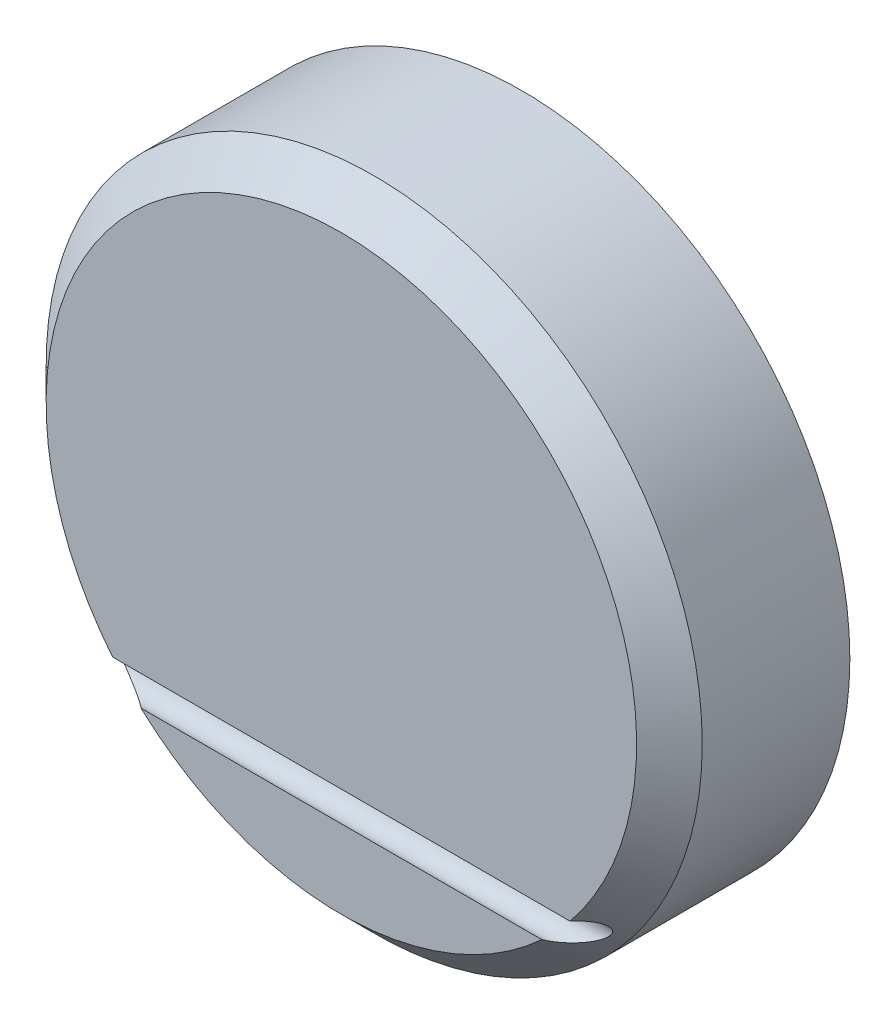
ISO-10303-21;
HEADER;
FILE_DESCRIPTION(('STEP AP214'),'2;1');
FILE_NAME('part.step','',(''),(''),'','','');
FILE_SCHEMA(('AUTOMOTIVE_DESIGN { 1 0 10303 214 1 1 1 1 }'));
ENDSEC;
DATA;
#1=APPLICATION_CONTEXT('core data for automotive mechanical design processes');
#2=APPLICATION_PROTOCOL_DEFINITION('international standard','automotive_design',2000,#1);
#3=PRODUCT_CONTEXT('',#1,'mechanical');
#4=PRODUCT('Part','Part','',(#3));
#5=PRODUCT_RELATED_PRODUCT_CATEGORY('part','',(#4));
#6=PRODUCT_DEFINITION_FORMATION('','',#4);
#7=PRODUCT_DEFINITION_CONTEXT('part definition',#1,'design');
#8=PRODUCT_DEFINITION('design','',#6,#7);
#9=PRODUCT_DEFINITION_SHAPE('','',#8);
#10=(LENGTH_UNIT() NAMED_UNIT(*) SI_UNIT(.MILLI.,.METRE.));
#11=(NAMED_UNIT(*) PLANE_ANGLE_UNIT() SI_UNIT($,.RADIAN.));
#12=(NAMED_UNIT(*) SI_UNIT($,.STERADIAN.) SOLID_ANGLE_UNIT());
#13=UNCERTAINTY_MEASURE_WITH_UNIT(LENGTH_MEASURE(1.E-05),#10,'distance_accuracy_value','');
#14=(GEOMETRIC_REPRESENTATION_CONTEXT(3) GLOBAL_UNCERTAINTY_ASSIGNED_CONTEXT((#13)) GLOBAL_UNIT_ASSIGNED_CONTEXT((#10,
#11,#12)) REPRESENTATION_CONTEXT('',''));
#15=CARTESIAN_POINT('',(0.,0.,0.));
#16=DIRECTION('',(0.,0.,1.));
#17=DIRECTION('',(1.,0.,0.));
#18=AXIS2_PLACEMENT_3D('',#15,#16,#17);
#19=CARTESIAN_POINT('',(0.,0.,0.));
#20=DIRECTION('',(0.,0.,1.));
#21=DIRECTION('',(1.,0.,0.));
#22=AXIS2_PLACEMENT_3D('',#19,#20,#21);
#23=PLANE('',#22);
#24=DIRECTION('',(1.,0.,0.));
#25=VECTOR('',#24,1.);
#26=CARTESIAN_POINT('',(-10.,-6.60825756949558,0.));
#27=LINE('',#26,#25);
#28=CARTESIAN_POINT('',(-6.10990440966177,-6.60825756949558,0.));
#29=VERTEX_POINT('',#28);
#30=CARTESIAN_POINT('',(6.10990440966177,-6.60825756949558,0.));
#31=VERTEX_POINT('',#30);
#32=EDGE_CURVE('E70',#29,#31,#27,.T.);
#33=ORIENTED_EDGE('',*,*,#32,.F.);
#34=CARTESIAN_POINT('',(0.,0.,0.));
#35=DIRECTION('',(0.,0.,1.));
#36=DIRECTION('',(1.,0.,0.));
#37=AXIS2_PLACEMENT_3D('',#34,#35,#36);
#38=CIRCLE('',#37,9.);
#39=EDGE_CURVE('E83',#29,#31,#38,.T.);
#40=ORIENTED_EDGE('',*,*,#39,.T.);
#41=EDGE_LOOP('',(#33,#40));
#42=FACE_BOUND('',#41,.T.);
#43=ADVANCED_FACE('F46',(#42),#23,.T.);
#44=CARTESIAN_POINT('',(0.,0.,-4.5));
#45=DIRECTION('',(0.,0.,1.));
#46=DIRECTION('',(1.,0.,0.));
#47=AXIS2_PLACEMENT_3D('',#44,#45,#46);
#48=PLANE('',#47);
#49=CARTESIAN_POINT('',(0.,0.,-4.5));
#50=DIRECTION('',(0.,0.,1.));
#51=DIRECTION('',(1.,0.,0.));
#52=AXIS2_PLACEMENT_3D('',#49,#50,#51);
#53=CIRCLE('',#52,8.25);
#54=CARTESIAN_POINT('',(8.25,0.,-4.5));
#55=VERTEX_POINT('',#54);
#56=EDGE_CURVE('E94',#55,#55,#53,.T.);
#57=ORIENTED_EDGE('',*,*,#56,.T.);
#58=EDGE_LOOP('',(#57));
#59=FACE_BOUND('',#58,.T.);
#60=CARTESIAN_POINT('',(0.,0.,-4.5));
#61=DIRECTION('',(0.,0.,-1.));
#62=DIRECTION('',(-1.,0.,0.));
#63=AXIS2_PLACEMENT_3D('',#60,#61,#62);
#64=CIRCLE('',#63,9.2);
#65=CARTESIAN_POINT('',(-9.2,0.,-4.5));
#66=VERTEX_POINT('',#65);
#67=EDGE_CURVE('E84',#66,#66,#64,.T.);
#68=ORIENTED_EDGE('',*,*,#67,.T.);
#69=EDGE_LOOP('',(#68));
#70=FACE_BOUND('',#69,.T.);
#71=ADVANCED_FACE('F125',(#59,#70),#48,.F.);
#72=CARTESIAN_POINT('',(0.,0.,-4.5));
#73=DIRECTION('',(0.,0.,1.));
#74=DIRECTION('',(1.,0.,0.));
#75=AXIS2_PLACEMENT_3D('',#72,#73,#74);
#76=CYLINDRICAL_SURFACE('',#75,8.25);
#77=CARTESIAN_POINT('',(0.,0.,-1.5));
#78=DIRECTION('',(0.,0.,1.));
#79=DIRECTION('',(1.,0.,0.));
#80=AXIS2_PLACEMENT_3D('',#77,#78,#79);
#81=CIRCLE('',#80,8.25);
#82=CARTESIAN_POINT('',(8.25,0.,-1.5));
#83=VERTEX_POINT('',#82);
#84=EDGE_CURVE('E80',#83,#83,#81,.T.);
#85=ORIENTED_EDGE('',*,*,#84,.T.);
#86=EDGE_LOOP('',(#85));
#87=FACE_BOUND('',#86,.T.);
#88=ORIENTED_EDGE('',*,*,#56,.F.);
#89=EDGE_LOOP('',(#88));
#90=FACE_BOUND('',#89,.T.);
#91=ADVANCED_FACE('F123',(#87,#90),#76,.F.);
#92=CARTESIAN_POINT('',(0.,0.,-1.));
#93=DIRECTION('',(0.,0.,1.));
#94=DIRECTION('',(1.,0.,0.));
#95=AXIS2_PLACEMENT_3D('',#92,#93,#94);
#96=PLANE('',#95);
#97=CARTESIAN_POINT('',(0.,0.,-1.));
#98=DIRECTION('',(0.,0.,1.));
#99=DIRECTION('',(1.,0.,0.));
#100=AXIS2_PLACEMENT_3D('',#97,#98,#99);
#101=CIRCLE('',#100,7.75);
#102=CARTESIAN_POINT('',(7.75,0.,-1.));
#103=VERTEX_POINT('',#102);
#104=EDGE_CURVE('E92',#103,#103,#101,.F.);
#105=ORIENTED_EDGE('',*,*,#104,.T.);
#106=EDGE_LOOP('',(#105));
#107=FACE_BOUND('',#106,.T.);
#108=ADVANCED_FACE('F119',(#107),#96,.F.);
#109=CARTESIAN_POINT('',(0.,0.,-5.5));
#110=DIRECTION('',(0.,0.,-1.));
#111=DIRECTION('',(-1.,0.,0.));
#112=AXIS2_PLACEMENT_3D('',#109,#110,#111);
#113=PLANE('',#112);
#114=CARTESIAN_POINT('',(0.,0.,-5.5));
#115=DIRECTION('',(0.,0.,-1.));
#116=DIRECTION('',(-1.,0.,0.));
#117=AXIS2_PLACEMENT_3D('',#114,#115,#116);
#118=CIRCLE('',#117,10.);
#119=CARTESIAN_POINT('',(-10.,0.,-5.5));
#120=VERTEX_POINT('',#119);
#121=EDGE_CURVE('E222',#120,#120,#118,.T.);
#122=ORIENTED_EDGE('',*,*,#121,.T.);
#123=EDGE_LOOP('',(#122));
#124=FACE_BOUND('',#123,.T.);
#125=CARTESIAN_POINT('',(0.,0.,-5.5));
#126=DIRECTION('',(0.,0.,-1.));
#127=DIRECTION('',(-1.,0.,0.));
#128=AXIS2_PLACEMENT_3D('',#125,#126,#127);
#129=CIRCLE('',#128,9.2);
#130=CARTESIAN_POINT('',(-9.2,0.,-5.5));
#131=VERTEX_POINT('',#130);
#132=EDGE_CURVE('E224',#131,#131,#129,.T.);
#133=ORIENTED_EDGE('',*,*,#132,.F.);
#134=EDGE_LOOP('',(#133));
#135=FACE_BOUND('',#134,.T.);
#136=ADVANCED_FACE('F115',(#124,#135),#113,.T.);
#137=CARTESIAN_POINT('',(0.,0.,-5.5));
#138=DIRECTION('',(0.,0.,1.));
#139=DIRECTION('',(1.,0.,0.));
#140=AXIS2_PLACEMENT_3D('',#137,#138,#139);
#141=CYLINDRICAL_SURFACE('',#140,9.2);
#142=ORIENTED_EDGE('',*,*,#132,.T.);
#143=EDGE_LOOP('',(#142));
#144=FACE_BOUND('',#143,.T.);
#145=ORIENTED_EDGE('',*,*,#67,.F.);
#146=EDGE_LOOP('',(#145));
#147=FACE_BOUND('',#146,.T.);
#148=ADVANCED_FACE('F110',(#144,#147),#141,.F.);
#149=DIRECTION('',(1.,0.,0.));
#150=VECTOR('',#149,1.);
#151=CARTESIAN_POINT('',(-10.,-5.69174243050442,0.));
#152=LINE('',#151,#150);
#153=CARTESIAN_POINT('',(6.97166178932941,-5.69174243050442,0.));
#154=VERTEX_POINT('',#153);
#155=CARTESIAN_POINT('',(-6.97166178932941,-5.69174243050442,0.));
#156=VERTEX_POINT('',#155);
#157=EDGE_CURVE('E65',#154,#156,#152,.F.);
#158=ORIENTED_EDGE('',*,*,#157,.F.);
#159=EDGE_CURVE('E89',#154,#156,#38,.T.);
#160=ORIENTED_EDGE('',*,*,#159,.T.);
#161=EDGE_LOOP('',(#158,#160));
#162=FACE_BOUND('',#161,.T.);
#163=ADVANCED_FACE('F114',(#162),#23,.T.);
#164=CARTESIAN_POINT('',(0.,0.,-4.5));
#165=DIRECTION('',(0.,0.,1.));
#166=DIRECTION('',(1.,0.,0.));
#167=AXIS2_PLACEMENT_3D('',#164,#165,#166);
#168=CYLINDRICAL_SURFACE('',#167,10.);
#169=CARTESIAN_POINT('',(0.,0.,-1.));
#170=DIRECTION('',(0.,0.,1.));
#171=DIRECTION('',(1.,0.,0.));
#172=AXIS2_PLACEMENT_3D('',#169,#170,#171);
#173=CIRCLE('',#172,10.);
#174=CARTESIAN_POINT('',(10.,0.,-1.));
#175=VERTEX_POINT('',#174);
#176=EDGE_CURVE('E88',#175,#175,#173,.F.);
#177=ORIENTED_EDGE('',*,*,#176,.T.);
#178=EDGE_LOOP('',(#177));
#179=FACE_BOUND('',#178,.T.);
#180=ORIENTED_EDGE('',*,*,#121,.F.);
#181=EDGE_LOOP('',(#180));
#182=FACE_BOUND('',#181,.T.);
#183=ADVANCED_FACE('F131',(#179,#182),#168,.T.);
#184=CARTESIAN_POINT('',(0.,0.,0.));
#185=DIRECTION('',(0.,0.,-1.));
#186=DIRECTION('',(-1.,0.,0.));
#187=AXIS2_PLACEMENT_3D('',#184,#185,#186);
#188=CONICAL_SURFACE('',#187,9.,0.785398163397447);
#189=CARTESIAN_POINT('',(6.04707990306705,-6.57070412405866,0.0702000000000661));
#190=CARTESIAN_POINT('',(6.05693556190833,-6.57881088669558,0.05756055493887));
#191=CARTESIAN_POINT('',(6.06754977139067,-6.58606310345228,0.045036347611117));
#192=CARTESIAN_POINT('',(6.08991784553527,-6.59906163342238,0.0203174837959343));
#193=CARTESIAN_POINT('',(6.10166717019198,-6.60481363093669,0.00812174513162114));
#194=CARTESIAN_POINT('',(6.13784049260138,-6.62006074375487,-0.0276340605502827));
#195=CARTESIAN_POINT('',(6.16348253832726,-6.62775892532108,-0.0507165070537371));
#196=CARTESIAN_POINT('',(6.21296748391777,-6.63871142905341,-0.0924846089058218));
#197=CARTESIAN_POINT('',(6.23657842432309,-6.64242880171015,-0.111340431121426));
#198=CARTESIAN_POINT('',(6.28472538204472,-6.64765167416868,-0.14815813985347));
#199=CARTESIAN_POINT('',(6.3092616883048,-6.64915647713574,-0.166119743021313));
#200=CARTESIAN_POINT('',(6.38430600743481,-6.65089900824148,-0.219141289813463));
#201=CARTESIAN_POINT('',(6.43577011489377,-6.64827737753146,-0.252948224364271));
#202=CARTESIAN_POINT('',(6.53199141355663,-6.63791048952041,-0.312761914263152));
#203=CARTESIAN_POINT('',(6.5765983457482,-6.63099164774556,-0.339178481180339));
#204=CARTESIAN_POINT('',(6.66622413025622,-6.61326974200197,-0.390018161700298));
#205=CARTESIAN_POINT('',(6.71124326022732,-6.60246383814802,-0.414439801761306));
#206=CARTESIAN_POINT('',(6.8011190118182,-6.57720676752466,-0.461143670958125));
#207=CARTESIAN_POINT('',(6.84597555619378,-6.56277048530252,-0.483434134991384));
#208=CARTESIAN_POINT('',(6.93535606231698,-6.53021308829522,-0.525808880840292));
#209=CARTESIAN_POINT('',(6.97988024662668,-6.5120947223237,-0.54589479131075));
#210=CARTESIAN_POINT('',(7.07255611966599,-6.46999544982295,-0.585378392279778));
#211=CARTESIAN_POINT('',(7.12063838721544,-6.44561525485041,-0.604518181024212));
#212=CARTESIAN_POINT('',(7.21524827149776,-6.39156892695091,-0.638946787583639));
#213=CARTESIAN_POINT('',(7.26177680574653,-6.36190598158968,-0.654237914295032));
#214=CARTESIAN_POINT('',(7.33772332168257,-6.30662018569768,-0.675445795955978));
#215=CARTESIAN_POINT('',(7.36793272510205,-6.28264587406788,-0.68279857351335));
#216=CARTESIAN_POINT('',(7.42607214929614,-6.23132149780307,-0.694042231051359));
#217=CARTESIAN_POINT('',(7.45400685425117,-6.20397867757412,-0.69794039753474));
#218=CARTESIAN_POINT('',(7.49572814351631,-6.1570847908733,-0.70026139326081));
#219=CARTESIAN_POINT('',(7.51074796429544,-6.13871649063703,-0.700237786807346));
#220=CARTESIAN_POINT('',(7.53875483040768,-6.10060428299812,-0.697919531804594));
#221=CARTESIAN_POINT('',(7.55174458332683,-6.0808622594981,-0.695627938618259));
#222=CARTESIAN_POINT('',(7.57225978314222,-6.04475996285982,-0.689061806754569));
#223=CARTESIAN_POINT('',(7.58035773915786,-6.02862835294889,-0.685344000874603));
#224=CARTESIAN_POINT('',(7.59430547231378,-5.99594694757036,-0.675978648612916));
#225=CARTESIAN_POINT('',(7.60015732625327,-5.97939755356218,-0.670332894031993));
#226=CARTESIAN_POINT('',(7.60916307784402,-5.94619019540221,-0.656929464640531));
#227=CARTESIAN_POINT('',(7.61228950223783,-5.92953279327653,-0.649151300183694));
#228=CARTESIAN_POINT('',(7.61541231376747,-5.89696907541784,-0.631643523312978));
#229=CARTESIAN_POINT('',(7.6154109532769,-5.88106222745234,-0.621915320204602));
#230=CARTESIAN_POINT('',(7.61255957023883,-5.85290943784665,-0.602474782959519));
#231=CARTESIAN_POINT('',(7.61013202473557,-5.84047041784632,-0.592974037227465));
#232=CARTESIAN_POINT('',(7.60327242113621,-5.81685683223351,-0.573166770178137));
#233=CARTESIAN_POINT('',(7.59883938509574,-5.80568288684129,-0.562859857777488));
#234=CARTESIAN_POINT('',(7.5863191433082,-5.78082730542186,-0.537827393324162));
#235=CARTESIAN_POINT('',(7.57748672776696,-5.76774830355218,-0.522878387903115));
#236=CARTESIAN_POINT('',(7.55743697654292,-5.74410185839354,-0.492605032005279));
#237=CARTESIAN_POINT('',(7.54621453192461,-5.733539899688,-0.477279940699215));
#238=CARTESIAN_POINT('',(7.51559970606161,-5.70965760509805,-0.438454662915463));
#239=CARTESIAN_POINT('',(7.49503874768254,-5.69786271368641,-0.41494616011404));
#240=CARTESIAN_POINT('',(7.45139443617641,-5.67859367385651,-0.36854725469748));
#241=CARTESIAN_POINT('',(7.4283056254029,-5.67112910235245,-0.345658328026037));
#242=CARTESIAN_POINT('',(7.3639215766288,-5.65574273511378,-0.285175356753404));
#243=CARTESIAN_POINT('',(7.32109986415549,-5.65109051376044,-0.248385765259092));
#244=CARTESIAN_POINT('',(7.23297143394436,-5.64924838128882,-0.177646104801658));
#245=CARTESIAN_POINT('',(7.18765610836174,-5.65208614286717,-0.143707045082126));
#246=CARTESIAN_POINT('',(7.09369002889107,-5.6640313145455,-0.0774718371415224));
#247=CARTESIAN_POINT('',(7.04497960544073,-5.67340270398823,-0.0453088085819697));
#248=CARTESIAN_POINT('',(6.9716585988871,-5.69152732195544,0.000160737329392793));
#249=CARTESIAN_POINT('',(6.94731165197608,-5.69819866769442,0.0147810730534031));
#250=CARTESIAN_POINT('',(6.89850932414168,-5.71281230315066,0.0431474223156409));
#251=CARTESIAN_POINT('',(6.87405401257705,-5.72075386963385,0.0568939272056057));
#252=CARTESIAN_POINT('',(6.84956179663639,-5.72929587594082,0.0701999999992615));
#253=B_SPLINE_CURVE_WITH_KNOTS('',3,(#189,#190,#191,#192,#193,#194,#195,#196,#197,#198,#199,
#200,#201,#202,#203,#204,#205,#206,#207,#208,#209,#210,#211,#212,#213,#214,#215,#216,#217,#218,
#219,#220,#221,#222,#223,#224,#225,#226,#227,#228,#229,#230,#231,#232,#233,#234,#235,#236,#237,
#238,#239,#240,#241,#242,#243,#244,#245,#246,#247,#248,#249,#250,#251,#252),.UNSPECIFIED.,.F.,
.F.,(4,2,2,2,2,2,2,2,2,2,2,2,2,2,2,2,2,2,2,2,2,2,2,2,2,2,2,2,2,2,2,4),(0.,0.0537720578594219,
0.107337313256323,0.212974109929849,0.304196077764694,0.395446769228391,0.57980147350798,
0.73653776012638,0.893388791536529,1.04960692995705,1.20570887128332,1.37702595868428,
1.54824002292585,1.66578121100592,1.78307388580991,1.85408402221921,1.92499862596251,
1.98008565105936,2.0351216179781,2.09070615570691,2.14625066603277,2.19355810990487,
2.24088864737849,2.30573777994154,2.37072695116419,2.47031804018471,2.57012855284241,
2.73912367397695,2.90874404234113,3.08564771295361,3.17313277764999,3.26056820656004),.UNSPECIFIED.);
#254=EDGE_CURVE('E13',#31,#154,#253,.T.);
#255=ORIENTED_EDGE('',*,*,#254,.F.);
#256=ORIENTED_EDGE('',*,*,#39,.F.);
#257=CARTESIAN_POINT('',(-6.84956179663635,-5.72929587594084,0.0701999999992805));
#258=CARTESIAN_POINT('',(-6.88502386030164,-5.71693904115684,0.0509283506669677));
#259=CARTESIAN_POINT('',(-6.92043320438293,-5.70581584357151,0.0307284602311027));
#260=CARTESIAN_POINT('',(-6.99105587636244,-5.68628584568431,-0.0115379335081343));
#261=CARTESIAN_POINT('',(-7.02626811684456,-5.67788848389883,-0.0336105957098764));
#262=CARTESIAN_POINT('',(-7.09636384316019,-5.6641078168228,-0.0796335511990398));
#263=CARTESIAN_POINT('',(-7.13124421472605,-5.65874237227737,-0.103594042609272));
#264=CARTESIAN_POINT('',(-7.2001019708125,-5.65156471416365,-0.15320003123186));
#265=CARTESIAN_POINT('',(-7.23408074121851,-5.64974669310318,-0.178842703271944));
#266=CARTESIAN_POINT('',(-7.29482778220748,-5.6502601259803,-0.227116235186326));
#267=CARTESIAN_POINT('',(-7.32181097296045,-5.65191640719346,-0.249480840883209));
#268=CARTESIAN_POINT('',(-7.37447569930938,-5.65862060636647,-0.295305205008734));
#269=CARTESIAN_POINT('',(-7.4001560420077,-5.66367157433251,-0.318765930609199));
#270=CARTESIAN_POINT('',(-7.44980205891208,-5.67800528507636,-0.366920826032508));
#271=CARTESIAN_POINT('',(-7.47374100303869,-5.68734235833125,-0.39162709173111));
#272=CARTESIAN_POINT('',(-7.51818853147913,-5.71134071948797,-0.441533214911757));
#273=CARTESIAN_POINT('',(-7.53871297201527,-5.72597633404429,-0.466730147142906));
#274=CARTESIAN_POINT('',(-7.56560750754979,-5.75316942589356,-0.504597582265442));
#275=CARTESIAN_POINT('',(-7.57404891918628,-5.7633654774665,-0.517488159938618));
#276=CARTESIAN_POINT('',(-7.5889255301962,-5.78563822690992,-0.542818257244841));
#277=CARTESIAN_POINT('',(-7.59536183490495,-5.79771388310371,-0.555258022038742));
#278=CARTESIAN_POINT('',(-7.60576918957378,-5.82384509043094,-0.579396858516405));
#279=CARTESIAN_POINT('',(-7.60971326587305,-5.83792035029786,-0.59108663524523));
#280=CARTESIAN_POINT('',(-7.61456855892256,-5.86761958013559,-0.613038497571632));
#281=CARTESIAN_POINT('',(-7.61548351903878,-5.88324161399105,-0.623302330296502));
#282=CARTESIAN_POINT('',(-7.61422783230705,-5.91336010708384,-0.64075531422342));
#283=CARTESIAN_POINT('',(-7.61243806825011,-5.92774376379773,-0.648170004593489));
#284=CARTESIAN_POINT('',(-7.60659485998603,-5.95677013917719,-0.661429524649801));
#285=CARTESIAN_POINT('',(-7.60254016802221,-5.97141299632784,-0.667273486385407));
#286=CARTESIAN_POINT('',(-7.59124644155118,-6.00407178988816,-0.678614338435176));
#287=CARTESIAN_POINT('',(-7.58347506533275,-6.02204891812496,-0.683687090176202));
#288=CARTESIAN_POINT('',(-7.5655768385225,-6.05729042876909,-0.691663555244427));
#289=CARTESIAN_POINT('',(-7.55544572720134,-6.07455345459612,-0.694563304581302));
#290=CARTESIAN_POINT('',(-7.52782909846106,-6.11668281838769,-0.699542009823449));
#291=CARTESIAN_POINT('',(-7.50922506635865,-6.14094638476348,-0.700451784978101));
#292=CARTESIAN_POINT('',(-7.46948735130025,-6.1871848227465,-0.699152456281717));
#293=CARTESIAN_POINT('',(-7.44834771376455,-6.20915407101472,-0.696935873940419));
#294=CARTESIAN_POINT('',(-7.38766601827658,-6.26692410264244,-0.687576201519377));
#295=CARTESIAN_POINT('',(-7.34639192549367,-6.30048544767584,-0.677964369842614));
#296=CARTESIAN_POINT('',(-7.261242471009,-6.36210639347175,-0.653983661886005));
#297=CARTESIAN_POINT('',(-7.21736037511758,-6.3901508670185,-0.639601988603807));
#298=CARTESIAN_POINT('',(-7.1335679372734,-6.43839420439228,-0.609311644265927));
#299=CARTESIAN_POINT('',(-7.09382005880399,-6.45913187806484,-0.593798729684689));
#300=CARTESIAN_POINT('',(-7.01364098659907,-6.49731506043846,-0.560573471294938));
#301=CARTESIAN_POINT('',(-6.97320928634837,-6.5147580008741,-0.542859429378737));
#302=CARTESIAN_POINT('',(-6.8919763615713,-6.54655053036468,-0.505530360824447));
#303=CARTESIAN_POINT('',(-6.85117488748895,-6.56089783841628,-0.485913947754307));
#304=CARTESIAN_POINT('',(-6.76946695133967,-6.58656035819244,-0.44494818614183));
#305=CARTESIAN_POINT('',(-6.728560454904,-6.5978744005922,-0.42359817341669));
#306=CARTESIAN_POINT('',(-6.65351176569677,-6.61581934021597,-0.382824294286682));
#307=CARTESIAN_POINT('',(-6.61934521674673,-6.62291165186368,-0.363647094066701));
#308=CARTESIAN_POINT('',(-6.55129586835793,-6.63479030740032,-0.324114886226983));
#309=CARTESIAN_POINT('',(-6.51741301911241,-6.63957706476622,-0.303760090530611));
#310=CARTESIAN_POINT('',(-6.45016308921273,-6.64661815368261,-0.261826716981375));
#311=CARTESIAN_POINT('',(-6.41679573595097,-6.64887387231242,-0.240248816242308));
#312=CARTESIAN_POINT('',(-6.35090177336737,-6.65047719286403,-0.195771319206678));
#313=CARTESIAN_POINT('',(-6.31837444094065,-6.64982738595497,-0.172872918527261));
#314=CARTESIAN_POINT('',(-6.25496842820304,-6.64502772039952,-0.125818924103253));
#315=CARTESIAN_POINT('',(-6.22407694900998,-6.64091141776689,-0.101677459329684));
#316=CARTESIAN_POINT('',(-6.16468567687159,-6.62824881285635,-0.051891131809951));
#317=CARTESIAN_POINT('',(-6.13617136620193,-6.61973210481922,-0.0262573150202356));
#318=CARTESIAN_POINT('',(-6.09836101085782,-6.60321503823855,0.0115390716646116));
#319=CARTESIAN_POINT('',(-6.08736391376292,-6.59767986275107,0.0230647991621016));
#320=CARTESIAN_POINT('',(-6.06637326932297,-6.58525761398848,0.0464257813146072));
#321=CARTESIAN_POINT('',(-6.05638560380402,-6.57836323869845,0.0582623945232996));
#322=CARTESIAN_POINT('',(-6.04707990306705,-6.57070412405866,0.0702000000000674));
#323=B_SPLINE_CURVE_WITH_KNOTS('',3,(#257,#258,#259,#260,#261,#262,#263,#264,#265,#266,#267,
#268,#269,#270,#271,#272,#273,#274,#275,#276,#277,#278,#279,#280,#281,#282,#283,#284,#285,#286,
#287,#288,#289,#290,#291,#292,#293,#294,#295,#296,#297,#298,#299,#300,#301,#302,#303,#304,#305,
#306,#307,#308,#309,#310,#311,#312,#313,#314,#315,#316,#317,#318,#319,#320,#321,#322),
.UNSPECIFIED.,.F.,.F.,(4,2,2,2,2,2,2,2,2,2,2,2,2,2,2,2,2,2,2,2,2,2,2,2,2,2,2,2,2,2,2,2,4),(0.,
0.126627915947603,0.253689730825603,0.381492454034941,0.509085775094129,0.614179758547792,
0.719368291687625,0.82592866309869,0.931979473929093,0.987242217829411,1.04247444345877,
1.0982946519473,1.15404585231271,1.20264299099922,1.25126692846015,1.31162568764286,
1.37209428700377,1.46334343788824,1.554811234398,1.71608328238215,1.87779155503355,
2.01991931901339,2.16215741935768,2.30449997199065,2.44689731907273,2.56627223008849,
2.68562572448833,2.80491377787288,2.9240954705189,3.04213656022791,3.15939392140409,
3.20991129841848,3.26070785221182),.UNSPECIFIED.);
#324=EDGE_CURVE('E59',#156,#29,#323,.T.);
#325=ORIENTED_EDGE('',*,*,#324,.F.);
#326=ORIENTED_EDGE('',*,*,#159,.F.);
#327=EDGE_LOOP('',(#255,#256,#325,#326));
#328=FACE_BOUND('',#327,.T.);
#329=ORIENTED_EDGE('',*,*,#176,.F.);
#330=EDGE_LOOP('',(#329));
#331=FACE_BOUND('',#330,.T.);
#332=ADVANCED_FACE('F86',(#328,#331),#188,.T.);
#333=CARTESIAN_POINT('',(0.,0.,-1.));
#334=DIRECTION('',(0.,0.,-1.));
#335=DIRECTION('',(-1.,0.,0.));
#336=AXIS2_PLACEMENT_3D('',#333,#334,#335);
#337=CONICAL_SURFACE('',#336,7.75,0.78539816339745);
#338=ORIENTED_EDGE('',*,*,#84,.F.);
#339=EDGE_LOOP('',(#338));
#340=FACE_BOUND('',#339,.T.);
#341=ORIENTED_EDGE('',*,*,#104,.F.);
#342=EDGE_LOOP('',(#341));
#343=FACE_BOUND('',#342,.T.);
#344=ADVANCED_FACE('F48',(#340,#343),#337,.F.);
#345=CARTESIAN_POINT('',(-10.,-6.15,-0.2));
#346=DIRECTION('',(1.,0.,0.));
#347=DIRECTION('',(0.,0.,-1.));
#348=AXIS2_PLACEMENT_3D('',#345,#346,#347);
#349=CYLINDRICAL_SURFACE('',#348,0.5);
#350=ORIENTED_EDGE('',*,*,#254,.T.);
#351=ORIENTED_EDGE('',*,*,#157,.T.);
#352=ORIENTED_EDGE('',*,*,#324,.T.);
#353=ORIENTED_EDGE('',*,*,#32,.T.);
#354=EDGE_LOOP('',(#350,#351,#352,#353));
#355=FACE_BOUND('',#354,.T.);
#356=ADVANCED_FACE('F75',(#355),#349,.F.);
#357=CLOSED_SHELL('',(#43,#71,#91,#108,#136,#148,#163,#183,#332,#344,#356));
#358=MANIFOLD_SOLID_BREP('B2',#357);
#359=ADVANCED_BREP_SHAPE_REPRESENTATION('',(#18,#358),#14);
#360=SHAPE_DEFINITION_REPRESENTATION(#9,#359);
ENDSEC;
END-ISO-10303-21;
